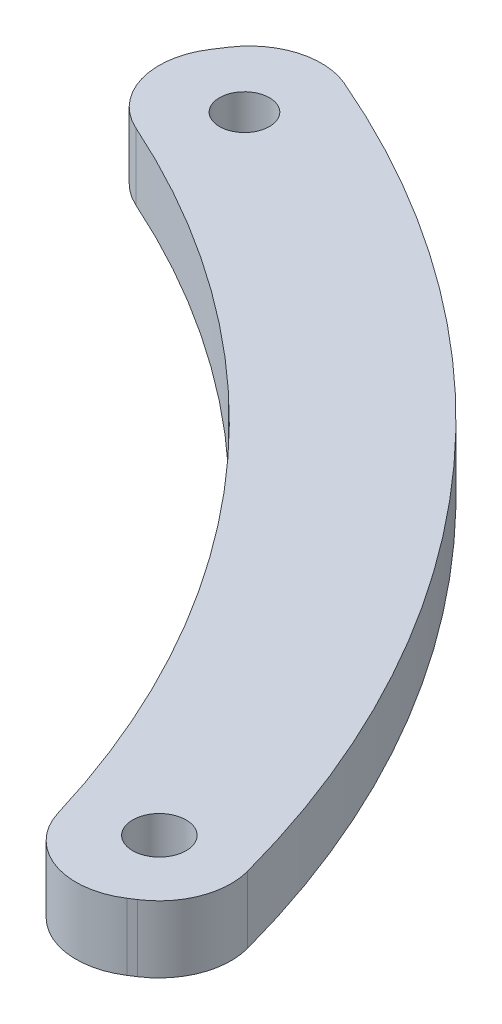
ISO-10303-21;
HEADER;
FILE_DESCRIPTION(('STEP AP214'),'2;1');
FILE_NAME('part.step','',(''),(''),'','','');
FILE_SCHEMA(('AUTOMOTIVE_DESIGN { 1 0 10303 214 1 1 1 1 }'));
ENDSEC;
DATA;
#1=APPLICATION_CONTEXT('core data for automotive mechanical design processes');
#2=APPLICATION_PROTOCOL_DEFINITION('international standard','automotive_design',2000,#1);
#3=PRODUCT_CONTEXT('',#1,'mechanical');
#4=PRODUCT('Part','Part','',(#3));
#5=PRODUCT_RELATED_PRODUCT_CATEGORY('part','',(#4));
#6=PRODUCT_DEFINITION_FORMATION('','',#4);
#7=PRODUCT_DEFINITION_CONTEXT('part definition',#1,'design');
#8=PRODUCT_DEFINITION('design','',#6,#7);
#9=PRODUCT_DEFINITION_SHAPE('','',#8);
#10=(LENGTH_UNIT() NAMED_UNIT(*) SI_UNIT(.MILLI.,.METRE.));
#11=(NAMED_UNIT(*) PLANE_ANGLE_UNIT() SI_UNIT($,.RADIAN.));
#12=(NAMED_UNIT(*) SI_UNIT($,.STERADIAN.) SOLID_ANGLE_UNIT());
#13=UNCERTAINTY_MEASURE_WITH_UNIT(LENGTH_MEASURE(1.E-05),#10,'distance_accuracy_value','');
#14=(GEOMETRIC_REPRESENTATION_CONTEXT(3) GLOBAL_UNCERTAINTY_ASSIGNED_CONTEXT((#13)) GLOBAL_UNIT_ASSIGNED_CONTEXT((#10,
#11,#12)) REPRESENTATION_CONTEXT('',''));
#15=CARTESIAN_POINT('',(0.,0.,0.));
#16=DIRECTION('',(0.,0.,1.));
#17=DIRECTION('',(1.,0.,0.));
#18=AXIS2_PLACEMENT_3D('',#15,#16,#17);
#19=CARTESIAN_POINT('',(-37.0866265053711,2.5,7.29671728478081));
#20=DIRECTION('',(0.,1.,0.));
#21=DIRECTION('',(0.,0.,1.));
#22=AXIS2_PLACEMENT_3D('',#19,#20,#21);
#23=PLANE('',#22);
#24=CARTESIAN_POINT('',(1.74577744463336,2.5,-4.70600672627996));
#25=DIRECTION('',(0.,1.,0.));
#26=DIRECTION('',(0.,0.,1.));
#27=AXIS2_PLACEMENT_3D('',#24,#25,#26);
#28=CIRCLE('',#27,1.);
#29=CARTESIAN_POINT('',(1.74577744463336,2.5,-3.70600672627996));
#30=VERTEX_POINT('',#29);
#31=EDGE_CURVE('E133',#30,#30,#28,.T.);
#32=ORIENTED_EDGE('',*,*,#31,.F.);
#33=EDGE_LOOP('',(#32));
#34=FACE_BOUND('',#33,.T.);
#35=CARTESIAN_POINT('',(-37.0866265053711,2.5,7.29671728478081));
#36=DIRECTION('',(0.,-1.,0.));
#37=DIRECTION('',(0.,0.,1.));
#38=AXIS2_PLACEMENT_3D('',#35,#36,#37);
#39=CIRCLE('',#38,37.7976182937882);
#40=CARTESIAN_POINT('',(-21.6174762658798,2.5,-27.1904591660532));
#41=VERTEX_POINT('',#40);
#42=CARTESIAN_POINT('',(-0.878543203717781,2.5,-3.54923367875611));
#43=VERTEX_POINT('',#42);
#44=EDGE_CURVE('E138',#41,#43,#39,.T.);
#45=ORIENTED_EDGE('',*,*,#44,.T.);
#46=CARTESIAN_POINT('',(1.7079114282803,2.5,-4.32399327799685));
#47=DIRECTION('',(0.,1.,0.));
#48=DIRECTION('',(0.,0.,1.));
#49=AXIS2_PLACEMENT_3D('',#46,#47,#48);
#50=CIRCLE('',#49,2.7);
#51=CARTESIAN_POINT('',(3.17616970643272,2.5,-2.05811207443897));
#52=VERTEX_POINT('',#51);
#53=EDGE_CURVE('E153',#43,#52,#50,.T.);
#54=ORIENTED_EDGE('',*,*,#53,.T.);
#55=DIRECTION('',(0.839215260576991,0.,-0.543799362278674));
#56=VECTOR('',#55,1.);
#57=CARTESIAN_POINT('',(0.,2.5,0.));
#58=LINE('',#57,#56);
#59=CARTESIAN_POINT('',(3.42383911083988,2.5,-2.21859826969709));
#60=VERTEX_POINT('',#59);
#61=EDGE_CURVE('E120',#52,#60,#58,.T.);
#62=ORIENTED_EDGE('',*,*,#61,.T.);
#63=CARTESIAN_POINT('',(1.95558083268746,2.5,-4.48447947325497));
#64=DIRECTION('',(0.,1.,0.));
#65=DIRECTION('',(0.,0.,1.));
#66=AXIS2_PLACEMENT_3D('',#63,#64,#65);
#67=CIRCLE('',#66,2.7);
#68=CARTESIAN_POINT('',(4.56147742286239,2.5,-5.19109320176205));
#69=VERTEX_POINT('',#68);
#70=EDGE_CURVE('E151',#60,#69,#67,.T.);
#71=ORIENTED_EDGE('',*,*,#70,.T.);
#72=CARTESIAN_POINT('',(-35.6206313703011,2.5,5.70466905552249));
#73=DIRECTION('',(0.,1.,0.));
#74=DIRECTION('',(0.,0.,1.));
#75=AXIS2_PLACEMENT_3D('',#72,#73,#74);
#76=CIRCLE('',#75,41.6331538828479);
#77=CARTESIAN_POINT('',(-19.1760765475203,2.5,-32.5431559664765));
#78=VERTEX_POINT('',#77);
#79=EDGE_CURVE('E173',#69,#78,#76,.T.);
#80=ORIENTED_EDGE('',*,*,#79,.T.);
#81=CARTESIAN_POINT('',(-20.242541465034,2.5,-30.0627018589163));
#82=DIRECTION('',(0.,1.,0.));
#83=DIRECTION('',(0.,0.,1.));
#84=AXIS2_PLACEMENT_3D('',#81,#82,#83);
#85=CIRCLE('',#84,2.7);
#86=CARTESIAN_POINT('',(-22.4955504296738,2.5,-31.5506368727031));
#87=VERTEX_POINT('',#86);
#88=EDGE_CURVE('E55',#78,#87,#85,.T.);
#89=ORIENTED_EDGE('',*,*,#88,.T.);
#90=DIRECTION('',(-0.551087042143276,0.,0.834447764681394));
#91=VECTOR('',#90,1.);
#92=CARTESIAN_POINT('',(-21.2855867627074,2.5,-33.3827457775308));
#93=LINE('',#92,#91);
#94=CARTESIAN_POINT('',(-22.7654763031848,2.5,-31.1419191483578));
#95=VERTEX_POINT('',#94);
#96=EDGE_CURVE('E139',#87,#95,#93,.T.);
#97=ORIENTED_EDGE('',*,*,#96,.T.);
#98=CARTESIAN_POINT('',(-20.5124673385451,2.5,-29.653984134571));
#99=DIRECTION('',(0.,1.,0.));
#100=DIRECTION('',(0.,0.,1.));
#101=AXIS2_PLACEMENT_3D('',#98,#99,#100);
#102=CIRCLE('',#101,2.7);
#103=EDGE_CURVE('E149',#95,#41,#102,.T.);
#104=ORIENTED_EDGE('',*,*,#103,.T.);
#105=EDGE_LOOP('',(#45,#54,#62,#71,#80,#89,#97,#104));
#106=FACE_BOUND('',#105,.T.);
#107=CARTESIAN_POINT('',(-20.0992093316095,2.5,-29.7353546199841));
#108=DIRECTION('',(0.,1.,0.));
#109=DIRECTION('',(0.,0.,-1.));
#110=AXIS2_PLACEMENT_3D('',#107,#108,#109);
#111=CIRCLE('',#110,0.936245513721901);
#112=CARTESIAN_POINT('',(-20.0992093316095,2.5,-30.671600133706));
#113=VERTEX_POINT('',#112);
#114=EDGE_CURVE('E185',#113,#113,#111,.T.);
#115=ORIENTED_EDGE('',*,*,#114,.F.);
#116=EDGE_LOOP('',(#115));
#117=FACE_BOUND('',#116,.T.);
#118=ADVANCED_FACE('F35',(#34,#106,#117),#23,.T.);
#119=CARTESIAN_POINT('',(-37.0866265053711,0.,7.29671728478081));
#120=DIRECTION('',(0.,1.,0.));
#121=DIRECTION('',(0.,0.,1.));
#122=AXIS2_PLACEMENT_3D('',#119,#120,#121);
#123=PLANE('',#122);
#124=DIRECTION('',(0.839215260576991,0.,-0.543799362278674));
#125=VECTOR('',#124,1.);
#126=CARTESIAN_POINT('',(0.,0.,0.));
#127=LINE('',#126,#125);
#128=CARTESIAN_POINT('',(3.17616970643272,0.,-2.05811207443897));
#129=VERTEX_POINT('',#128);
#130=CARTESIAN_POINT('',(3.42383911083988,0.,-2.21859826969709));
#131=VERTEX_POINT('',#130);
#132=EDGE_CURVE('E117',#129,#131,#127,.T.);
#133=ORIENTED_EDGE('',*,*,#132,.F.);
#134=CARTESIAN_POINT('',(1.7079114282803,0.,-4.32399327799685));
#135=DIRECTION('',(0.,1.,0.));
#136=DIRECTION('',(0.,0.,1.));
#137=AXIS2_PLACEMENT_3D('',#134,#135,#136);
#138=CIRCLE('',#137,2.7);
#139=CARTESIAN_POINT('',(-0.878543203717781,0.,-3.54923367875611));
#140=VERTEX_POINT('',#139);
#141=EDGE_CURVE('E100',#129,#140,#138,.F.);
#142=ORIENTED_EDGE('',*,*,#141,.T.);
#143=CARTESIAN_POINT('',(-37.0866265053711,0.,7.29671728478081));
#144=DIRECTION('',(0.,-1.,0.));
#145=DIRECTION('',(0.,0.,1.));
#146=AXIS2_PLACEMENT_3D('',#143,#144,#145);
#147=CIRCLE('',#146,37.7976182937882);
#148=CARTESIAN_POINT('',(-21.6174762658798,0.,-27.1904591660532));
#149=VERTEX_POINT('',#148);
#150=EDGE_CURVE('E128',#149,#140,#147,.T.);
#151=ORIENTED_EDGE('',*,*,#150,.F.);
#152=CARTESIAN_POINT('',(-20.5124673385451,0.,-29.653984134571));
#153=DIRECTION('',(0.,1.,0.));
#154=DIRECTION('',(0.,0.,1.));
#155=AXIS2_PLACEMENT_3D('',#152,#153,#154);
#156=CIRCLE('',#155,2.7);
#157=CARTESIAN_POINT('',(-22.7654763031848,0.,-31.1419191483578));
#158=VERTEX_POINT('',#157);
#159=EDGE_CURVE('E142',#149,#158,#156,.F.);
#160=ORIENTED_EDGE('',*,*,#159,.T.);
#161=DIRECTION('',(-0.551087042143276,0.,0.834447764681394));
#162=VECTOR('',#161,1.);
#163=CARTESIAN_POINT('',(-21.2855867627074,0.,-33.3827457775308));
#164=LINE('',#163,#162);
#165=CARTESIAN_POINT('',(-22.4955504296738,0.,-31.5506368727031));
#166=VERTEX_POINT('',#165);
#167=EDGE_CURVE('E131',#166,#158,#164,.T.);
#168=ORIENTED_EDGE('',*,*,#167,.F.);
#169=CARTESIAN_POINT('',(-20.242541465034,0.,-30.0627018589163));
#170=DIRECTION('',(0.,1.,0.));
#171=DIRECTION('',(0.,0.,1.));
#172=AXIS2_PLACEMENT_3D('',#169,#170,#171);
#173=CIRCLE('',#172,2.7);
#174=CARTESIAN_POINT('',(-19.1760765475203,0.,-32.5431559664765));
#175=VERTEX_POINT('',#174);
#176=EDGE_CURVE('E121',#166,#175,#173,.F.);
#177=ORIENTED_EDGE('',*,*,#176,.T.);
#178=CARTESIAN_POINT('',(-35.6206313703011,0.,5.70466905552249));
#179=DIRECTION('',(0.,1.,0.));
#180=DIRECTION('',(0.,0.,1.));
#181=AXIS2_PLACEMENT_3D('',#178,#179,#180);
#182=CIRCLE('',#181,41.6331538828479);
#183=CARTESIAN_POINT('',(4.56147742286239,0.,-5.19109320176205));
#184=VERTEX_POINT('',#183);
#185=EDGE_CURVE('E127',#184,#175,#182,.T.);
#186=ORIENTED_EDGE('',*,*,#185,.F.);
#187=CARTESIAN_POINT('',(1.95558083268746,0.,-4.48447947325497));
#188=DIRECTION('',(0.,1.,0.));
#189=DIRECTION('',(0.,0.,1.));
#190=AXIS2_PLACEMENT_3D('',#187,#188,#189);
#191=CIRCLE('',#190,2.7);
#192=EDGE_CURVE('E111',#184,#131,#191,.F.);
#193=ORIENTED_EDGE('',*,*,#192,.T.);
#194=EDGE_LOOP('',(#133,#142,#151,#160,#168,#177,#186,#193));
#195=FACE_BOUND('',#194,.T.);
#196=CARTESIAN_POINT('',(1.74577744463336,0.,-4.70600672627996));
#197=DIRECTION('',(0.,1.,0.));
#198=DIRECTION('',(0.,0.,1.));
#199=AXIS2_PLACEMENT_3D('',#196,#197,#198);
#200=CIRCLE('',#199,1.);
#201=CARTESIAN_POINT('',(1.74577744463336,0.,-3.70600672627996));
#202=VERTEX_POINT('',#201);
#203=EDGE_CURVE('E176',#202,#202,#200,.T.);
#204=ORIENTED_EDGE('',*,*,#203,.T.);
#205=EDGE_LOOP('',(#204));
#206=FACE_BOUND('',#205,.T.);
#207=CARTESIAN_POINT('',(-20.0992093316095,0.,-29.7353546199841));
#208=DIRECTION('',(0.,1.,0.));
#209=DIRECTION('',(0.,0.,-1.));
#210=AXIS2_PLACEMENT_3D('',#207,#208,#209);
#211=CIRCLE('',#210,0.936245513721901);
#212=CARTESIAN_POINT('',(-20.0992093316095,0.,-30.671600133706));
#213=VERTEX_POINT('',#212);
#214=EDGE_CURVE('E187',#213,#213,#211,.T.);
#215=ORIENTED_EDGE('',*,*,#214,.T.);
#216=EDGE_LOOP('',(#215));
#217=FACE_BOUND('',#216,.T.);
#218=ADVANCED_FACE('F124',(#195,#206,#217),#123,.F.);
#219=CARTESIAN_POINT('',(-37.0866265053711,2.5,7.29671728478081));
#220=DIRECTION('',(0.,-1.,0.));
#221=DIRECTION('',(0.,0.,-1.));
#222=AXIS2_PLACEMENT_3D('',#219,#220,#221);
#223=CYLINDRICAL_SURFACE('',#222,37.7976182937882);
#224=ORIENTED_EDGE('',*,*,#150,.T.);
#225=DIRECTION('',(0.,-1.,0.));
#226=VECTOR('',#225,1.);
#227=CARTESIAN_POINT('',(-0.878543203717774,2.5,-3.54923367875611));
#228=LINE('',#227,#226);
#229=EDGE_CURVE('E105',#140,#43,#228,.F.);
#230=ORIENTED_EDGE('',*,*,#229,.T.);
#231=ORIENTED_EDGE('',*,*,#44,.F.);
#232=DIRECTION('',(0.,-1.,0.));
#233=VECTOR('',#232,1.);
#234=CARTESIAN_POINT('',(-21.6174762658798,2.5,-27.1904591660532));
#235=LINE('',#234,#233);
#236=EDGE_CURVE('E110',#41,#149,#235,.T.);
#237=ORIENTED_EDGE('',*,*,#236,.T.);
#238=EDGE_LOOP('',(#224,#230,#231,#237));
#239=FACE_BOUND('',#238,.T.);
#240=ADVANCED_FACE('F170',(#239),#223,.F.);
#241=CARTESIAN_POINT('',(0.,2.5,0.));
#242=DIRECTION('',(-0.543799362278674,0.,-0.839215260576991));
#243=DIRECTION('',(-0.839215260576991,0.,0.543799362278674));
#244=AXIS2_PLACEMENT_3D('',#241,#242,#243);
#245=PLANE('',#244);
#246=ORIENTED_EDGE('',*,*,#61,.F.);
#247=DIRECTION('',(0.,-1.,0.));
#248=VECTOR('',#247,1.);
#249=CARTESIAN_POINT('',(3.17616970643272,2.5,-2.05811207443897));
#250=LINE('',#249,#248);
#251=EDGE_CURVE('E104',#52,#129,#250,.T.);
#252=ORIENTED_EDGE('',*,*,#251,.T.);
#253=ORIENTED_EDGE('',*,*,#132,.T.);
#254=DIRECTION('',(0.,-1.,0.));
#255=VECTOR('',#254,1.);
#256=CARTESIAN_POINT('',(3.42383911083988,2.5,-2.21859826969709));
#257=LINE('',#256,#255);
#258=EDGE_CURVE('E122',#131,#60,#257,.F.);
#259=ORIENTED_EDGE('',*,*,#258,.T.);
#260=EDGE_LOOP('',(#246,#252,#253,#259));
#261=FACE_BOUND('',#260,.T.);
#262=ADVANCED_FACE('F116',(#261),#245,.F.);
#263=CARTESIAN_POINT('',(-35.6206313703011,2.5,5.70466905552249));
#264=DIRECTION('',(0.,-1.,0.));
#265=DIRECTION('',(0.,0.,-1.));
#266=AXIS2_PLACEMENT_3D('',#263,#264,#265);
#267=CYLINDRICAL_SURFACE('',#266,41.6331538828479);
#268=ORIENTED_EDGE('',*,*,#79,.F.);
#269=DIRECTION('',(0.,-1.,0.));
#270=VECTOR('',#269,1.);
#271=CARTESIAN_POINT('',(4.56147742286239,2.5,-5.19109320176205));
#272=LINE('',#271,#270);
#273=EDGE_CURVE('E157',#69,#184,#272,.T.);
#274=ORIENTED_EDGE('',*,*,#273,.T.);
#275=ORIENTED_EDGE('',*,*,#185,.T.);
#276=DIRECTION('',(0.,-1.,0.));
#277=VECTOR('',#276,1.);
#278=CARTESIAN_POINT('',(-19.1760765475203,2.5,-32.5431559664765));
#279=LINE('',#278,#277);
#280=EDGE_CURVE('E155',#175,#78,#279,.F.);
#281=ORIENTED_EDGE('',*,*,#280,.T.);
#282=EDGE_LOOP('',(#268,#274,#275,#281));
#283=FACE_BOUND('',#282,.T.);
#284=ADVANCED_FACE('F216',(#283),#267,.T.);
#285=CARTESIAN_POINT('',(-21.2855867627074,2.5,-33.3827457775308));
#286=DIRECTION('',(0.834447764681394,0.,0.551087042143276));
#287=DIRECTION('',(0.551087042143276,0.,-0.834447764681394));
#288=AXIS2_PLACEMENT_3D('',#285,#286,#287);
#289=PLANE('',#288);
#290=ORIENTED_EDGE('',*,*,#167,.T.);
#291=DIRECTION('',(0.,-1.,0.));
#292=VECTOR('',#291,1.);
#293=CARTESIAN_POINT('',(-22.7654763031848,2.5,-31.1419191483578));
#294=LINE('',#293,#292);
#295=EDGE_CURVE('E11',#158,#95,#294,.F.);
#296=ORIENTED_EDGE('',*,*,#295,.T.);
#297=ORIENTED_EDGE('',*,*,#96,.F.);
#298=DIRECTION('',(0.,-1.,0.));
#299=VECTOR('',#298,1.);
#300=CARTESIAN_POINT('',(-22.4955504296738,2.5,-31.5506368727031));
#301=LINE('',#300,#299);
#302=EDGE_CURVE('E43',#87,#166,#301,.T.);
#303=ORIENTED_EDGE('',*,*,#302,.T.);
#304=EDGE_LOOP('',(#290,#296,#297,#303));
#305=FACE_BOUND('',#304,.T.);
#306=ADVANCED_FACE('F162',(#305),#289,.F.);
#307=CARTESIAN_POINT('',(1.74577744463336,2.5,-4.70600672627996));
#308=DIRECTION('',(0.,-1.,0.));
#309=DIRECTION('',(0.,0.,-1.));
#310=AXIS2_PLACEMENT_3D('',#307,#308,#309);
#311=CYLINDRICAL_SURFACE('',#310,1.);
#312=ORIENTED_EDGE('',*,*,#31,.T.);
#313=EDGE_LOOP('',(#312));
#314=FACE_BOUND('',#313,.T.);
#315=ORIENTED_EDGE('',*,*,#203,.F.);
#316=EDGE_LOOP('',(#315));
#317=FACE_BOUND('',#316,.T.);
#318=ADVANCED_FACE('F195',(#314,#317),#311,.F.);
#319=CARTESIAN_POINT('',(-20.0992093316095,2.5,-29.7353546199841));
#320=DIRECTION('',(0.,-1.,0.));
#321=DIRECTION('',(0.,0.,-1.));
#322=AXIS2_PLACEMENT_3D('',#319,#320,#321);
#323=CYLINDRICAL_SURFACE('',#322,0.936245513721901);
#324=ORIENTED_EDGE('',*,*,#114,.T.);
#325=EDGE_LOOP('',(#324));
#326=FACE_BOUND('',#325,.T.);
#327=ORIENTED_EDGE('',*,*,#214,.F.);
#328=EDGE_LOOP('',(#327));
#329=FACE_BOUND('',#328,.T.);
#330=ADVANCED_FACE('F198',(#326,#329),#323,.F.);
#331=CARTESIAN_POINT('',(1.7079114282803,2.5,-4.32399327799685));
#332=DIRECTION('',(0.,-1.,0.));
#333=DIRECTION('',(0.,0.,-1.));
#334=AXIS2_PLACEMENT_3D('',#331,#332,#333);
#335=CYLINDRICAL_SURFACE('',#334,2.7);
#336=ORIENTED_EDGE('',*,*,#53,.F.);
#337=ORIENTED_EDGE('',*,*,#229,.F.);
#338=ORIENTED_EDGE('',*,*,#141,.F.);
#339=ORIENTED_EDGE('',*,*,#251,.F.);
#340=EDGE_LOOP('',(#336,#337,#338,#339));
#341=FACE_BOUND('',#340,.T.);
#342=ADVANCED_FACE('F103',(#341),#335,.T.);
#343=CARTESIAN_POINT('',(1.95558083268746,2.5,-4.48447947325497));
#344=DIRECTION('',(0.,-1.,0.));
#345=DIRECTION('',(0.,0.,-1.));
#346=AXIS2_PLACEMENT_3D('',#343,#344,#345);
#347=CYLINDRICAL_SURFACE('',#346,2.7);
#348=ORIENTED_EDGE('',*,*,#70,.F.);
#349=ORIENTED_EDGE('',*,*,#258,.F.);
#350=ORIENTED_EDGE('',*,*,#192,.F.);
#351=ORIENTED_EDGE('',*,*,#273,.F.);
#352=EDGE_LOOP('',(#348,#349,#350,#351));
#353=FACE_BOUND('',#352,.T.);
#354=ADVANCED_FACE('F211',(#353),#347,.T.);
#355=CARTESIAN_POINT('',(-20.5124673385451,2.5,-29.653984134571));
#356=DIRECTION('',(0.,-1.,0.));
#357=DIRECTION('',(0.,0.,-1.));
#358=AXIS2_PLACEMENT_3D('',#355,#356,#357);
#359=CYLINDRICAL_SURFACE('',#358,2.7);
#360=ORIENTED_EDGE('',*,*,#103,.F.);
#361=ORIENTED_EDGE('',*,*,#295,.F.);
#362=ORIENTED_EDGE('',*,*,#159,.F.);
#363=ORIENTED_EDGE('',*,*,#236,.F.);
#364=EDGE_LOOP('',(#360,#361,#362,#363));
#365=FACE_BOUND('',#364,.T.);
#366=ADVANCED_FACE('F167',(#365),#359,.T.);
#367=CARTESIAN_POINT('',(-20.242541465034,2.5,-30.0627018589163));
#368=DIRECTION('',(0.,-1.,0.));
#369=DIRECTION('',(0.,0.,-1.));
#370=AXIS2_PLACEMENT_3D('',#367,#368,#369);
#371=CYLINDRICAL_SURFACE('',#370,2.7);
#372=ORIENTED_EDGE('',*,*,#88,.F.);
#373=ORIENTED_EDGE('',*,*,#280,.F.);
#374=ORIENTED_EDGE('',*,*,#176,.F.);
#375=ORIENTED_EDGE('',*,*,#302,.F.);
#376=EDGE_LOOP('',(#372,#373,#374,#375));
#377=FACE_BOUND('',#376,.T.);
#378=ADVANCED_FACE('F37',(#377),#371,.T.);
#379=CLOSED_SHELL('',(#118,#218,#240,#262,#284,#306,#318,#330,#342,#354,#366,#378));
#380=MANIFOLD_SOLID_BREP('B2',#379);
#381=ADVANCED_BREP_SHAPE_REPRESENTATION('',(#18,#380),#14);
#382=SHAPE_DEFINITION_REPRESENTATION(#9,#381);
ENDSEC;
END-ISO-10303-21;
